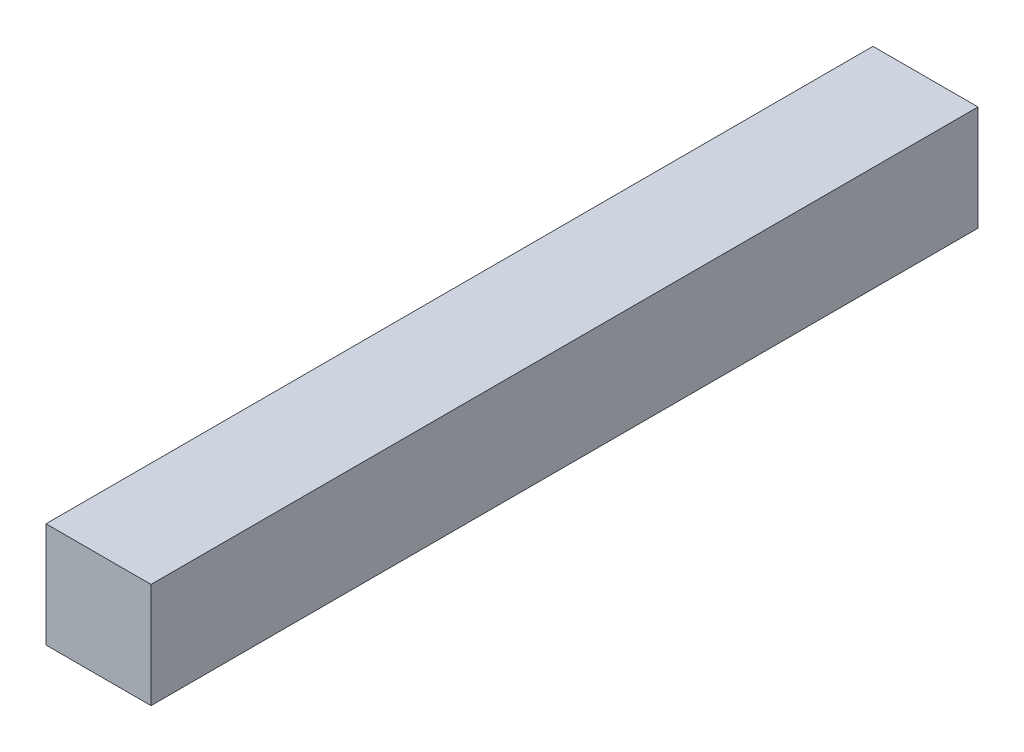
ISO-10303-21;
HEADER;
FILE_DESCRIPTION(('STEP AP214'),'2;1');
FILE_NAME('part.step','',(''),(''),'','','');
FILE_SCHEMA(('AUTOMOTIVE_DESIGN { 1 0 10303 214 1 1 1 1 }'));
ENDSEC;
DATA;
#1=APPLICATION_CONTEXT('core data for automotive mechanical design processes');
#2=APPLICATION_PROTOCOL_DEFINITION('international standard','automotive_design',2000,#1);
#3=PRODUCT_CONTEXT('',#1,'mechanical');
#4=PRODUCT('Part','Part','',(#3));
#5=PRODUCT_RELATED_PRODUCT_CATEGORY('part','',(#4));
#6=PRODUCT_DEFINITION_FORMATION('','',#4);
#7=PRODUCT_DEFINITION_CONTEXT('part definition',#1,'design');
#8=PRODUCT_DEFINITION('design','',#6,#7);
#9=PRODUCT_DEFINITION_SHAPE('','',#8);
#10=(LENGTH_UNIT() NAMED_UNIT(*) SI_UNIT(.MILLI.,.METRE.));
#11=(NAMED_UNIT(*) PLANE_ANGLE_UNIT() SI_UNIT($,.RADIAN.));
#12=(NAMED_UNIT(*) SI_UNIT($,.STERADIAN.) SOLID_ANGLE_UNIT());
#13=UNCERTAINTY_MEASURE_WITH_UNIT(LENGTH_MEASURE(1.E-05),#10,'distance_accuracy_value','');
#14=(GEOMETRIC_REPRESENTATION_CONTEXT(3) GLOBAL_UNCERTAINTY_ASSIGNED_CONTEXT((#13)) GLOBAL_UNIT_ASSIGNED_CONTEXT((#10,
#11,#12)) REPRESENTATION_CONTEXT('',''));
#15=CARTESIAN_POINT('',(0.,0.,0.));
#16=DIRECTION('',(0.,0.,1.));
#17=DIRECTION('',(1.,0.,0.));
#18=AXIS2_PLACEMENT_3D('',#15,#16,#17);
#19=CARTESIAN_POINT('',(1.5875,-1.5875,25.));
#20=DIRECTION('',(-1.,0.,0.));
#21=DIRECTION('',(0.,0.,1.));
#22=AXIS2_PLACEMENT_3D('',#19,#20,#21);
#23=PLANE('',#22);
#24=DIRECTION('',(0.,1.,0.));
#25=VECTOR('',#24,1.);
#26=CARTESIAN_POINT('',(1.5875,-1.5875,0.));
#27=LINE('',#26,#25);
#28=CARTESIAN_POINT('',(1.5875,-1.5875,0.));
#29=VERTEX_POINT('',#28);
#30=CARTESIAN_POINT('',(1.5875,1.5875,0.));
#31=VERTEX_POINT('',#30);
#32=EDGE_CURVE('E107',#29,#31,#27,.T.);
#33=ORIENTED_EDGE('',*,*,#32,.T.);
#34=DIRECTION('',(0.,0.,-1.));
#35=VECTOR('',#34,1.);
#36=CARTESIAN_POINT('',(1.5875,1.5875,25.));
#37=LINE('',#36,#35);
#38=CARTESIAN_POINT('',(1.5875,1.5875,25.));
#39=VERTEX_POINT('',#38);
#40=EDGE_CURVE('E11',#39,#31,#37,.T.);
#41=ORIENTED_EDGE('',*,*,#40,.F.);
#42=DIRECTION('',(0.,1.,0.));
#43=VECTOR('',#42,1.);
#44=CARTESIAN_POINT('',(1.5875,-1.5875,25.));
#45=LINE('',#44,#43);
#46=CARTESIAN_POINT('',(1.5875,-1.5875,25.));
#47=VERTEX_POINT('',#46);
#48=EDGE_CURVE('E91',#47,#39,#45,.T.);
#49=ORIENTED_EDGE('',*,*,#48,.F.);
#50=DIRECTION('',(0.,0.,-1.));
#51=VECTOR('',#50,1.);
#52=CARTESIAN_POINT('',(1.5875,-1.5875,25.));
#53=LINE('',#52,#51);
#54=EDGE_CURVE('E103',#47,#29,#53,.T.);
#55=ORIENTED_EDGE('',*,*,#54,.T.);
#56=EDGE_LOOP('',(#33,#41,#49,#55));
#57=FACE_BOUND('',#56,.T.);
#58=ADVANCED_FACE('F39',(#57),#23,.F.);
#59=CARTESIAN_POINT('',(-1.5875,1.5875,25.));
#60=DIRECTION('',(0.,-1.,0.));
#61=DIRECTION('',(0.,0.,-1.));
#62=AXIS2_PLACEMENT_3D('',#59,#60,#61);
#63=PLANE('',#62);
#64=DIRECTION('',(-1.,0.,0.));
#65=VECTOR('',#64,1.);
#66=CARTESIAN_POINT('',(-1.5875,1.5875,0.));
#67=LINE('',#66,#65);
#68=CARTESIAN_POINT('',(-1.5875,1.5875,0.));
#69=VERTEX_POINT('',#68);
#70=EDGE_CURVE('E96',#31,#69,#67,.T.);
#71=ORIENTED_EDGE('',*,*,#70,.T.);
#72=DIRECTION('',(0.,0.,-1.));
#73=VECTOR('',#72,1.);
#74=CARTESIAN_POINT('',(-1.5875,1.5875,25.));
#75=LINE('',#74,#73);
#76=CARTESIAN_POINT('',(-1.5875,1.5875,25.));
#77=VERTEX_POINT('',#76);
#78=EDGE_CURVE('E48',#77,#69,#75,.T.);
#79=ORIENTED_EDGE('',*,*,#78,.F.);
#80=DIRECTION('',(-1.,0.,0.));
#81=VECTOR('',#80,1.);
#82=CARTESIAN_POINT('',(-1.5875,1.5875,25.));
#83=LINE('',#82,#81);
#84=EDGE_CURVE('E86',#39,#77,#83,.T.);
#85=ORIENTED_EDGE('',*,*,#84,.F.);
#86=ORIENTED_EDGE('',*,*,#40,.T.);
#87=EDGE_LOOP('',(#71,#79,#85,#86));
#88=FACE_BOUND('',#87,.T.);
#89=ADVANCED_FACE('F95',(#88),#63,.F.);
#90=CARTESIAN_POINT('',(-1.5875,-1.5875,25.));
#91=DIRECTION('',(1.,0.,0.));
#92=DIRECTION('',(0.,0.,-1.));
#93=AXIS2_PLACEMENT_3D('',#90,#91,#92);
#94=PLANE('',#93);
#95=DIRECTION('',(0.,-1.,0.));
#96=VECTOR('',#95,1.);
#97=CARTESIAN_POINT('',(-1.5875,-1.5875,0.));
#98=LINE('',#97,#96);
#99=CARTESIAN_POINT('',(-1.5875,-1.5875,0.));
#100=VERTEX_POINT('',#99);
#101=EDGE_CURVE('E73',#69,#100,#98,.T.);
#102=ORIENTED_EDGE('',*,*,#101,.T.);
#103=DIRECTION('',(0.,0.,-1.));
#104=VECTOR('',#103,1.);
#105=CARTESIAN_POINT('',(-1.5875,-1.5875,25.));
#106=LINE('',#105,#104);
#107=CARTESIAN_POINT('',(-1.5875,-1.5875,25.));
#108=VERTEX_POINT('',#107);
#109=EDGE_CURVE('E98',#108,#100,#106,.T.);
#110=ORIENTED_EDGE('',*,*,#109,.F.);
#111=DIRECTION('',(0.,-1.,0.));
#112=VECTOR('',#111,1.);
#113=CARTESIAN_POINT('',(-1.5875,-1.5875,25.));
#114=LINE('',#113,#112);
#115=EDGE_CURVE('E89',#77,#108,#114,.T.);
#116=ORIENTED_EDGE('',*,*,#115,.F.);
#117=ORIENTED_EDGE('',*,*,#78,.T.);
#118=EDGE_LOOP('',(#102,#110,#116,#117));
#119=FACE_BOUND('',#118,.T.);
#120=ADVANCED_FACE('F99',(#119),#94,.F.);
#121=CARTESIAN_POINT('',(-1.5875,-1.5875,25.));
#122=DIRECTION('',(0.,1.,0.));
#123=DIRECTION('',(0.,0.,1.));
#124=AXIS2_PLACEMENT_3D('',#121,#122,#123);
#125=PLANE('',#124);
#126=DIRECTION('',(1.,0.,0.));
#127=VECTOR('',#126,1.);
#128=CARTESIAN_POINT('',(-1.5875,-1.5875,0.));
#129=LINE('',#128,#127);
#130=EDGE_CURVE('E79',#100,#29,#129,.T.);
#131=ORIENTED_EDGE('',*,*,#130,.T.);
#132=ORIENTED_EDGE('',*,*,#54,.F.);
#133=DIRECTION('',(1.,0.,0.));
#134=VECTOR('',#133,1.);
#135=CARTESIAN_POINT('',(-1.5875,-1.5875,25.));
#136=LINE('',#135,#134);
#137=EDGE_CURVE('E56',#108,#47,#136,.T.);
#138=ORIENTED_EDGE('',*,*,#137,.F.);
#139=ORIENTED_EDGE('',*,*,#109,.T.);
#140=EDGE_LOOP('',(#131,#132,#138,#139));
#141=FACE_BOUND('',#140,.T.);
#142=ADVANCED_FACE('F120',(#141),#125,.F.);
#143=CARTESIAN_POINT('',(0.,0.,25.));
#144=DIRECTION('',(0.,0.,-1.));
#145=DIRECTION('',(-1.,0.,0.));
#146=AXIS2_PLACEMENT_3D('',#143,#144,#145);
#147=PLANE('',#146);
#148=ORIENTED_EDGE('',*,*,#48,.T.);
#149=ORIENTED_EDGE('',*,*,#84,.T.);
#150=ORIENTED_EDGE('',*,*,#115,.T.);
#151=ORIENTED_EDGE('',*,*,#137,.T.);
#152=EDGE_LOOP('',(#148,#149,#150,#151));
#153=FACE_BOUND('',#152,.T.);
#154=ADVANCED_FACE('F87',(#153),#147,.F.);
#155=CARTESIAN_POINT('',(0.,0.,0.));
#156=DIRECTION('',(0.,0.,-1.));
#157=DIRECTION('',(-1.,0.,0.));
#158=AXIS2_PLACEMENT_3D('',#155,#156,#157);
#159=PLANE('',#158);
#160=ORIENTED_EDGE('',*,*,#32,.F.);
#161=ORIENTED_EDGE('',*,*,#130,.F.);
#162=ORIENTED_EDGE('',*,*,#101,.F.);
#163=ORIENTED_EDGE('',*,*,#70,.F.);
#164=EDGE_LOOP('',(#160,#161,#162,#163));
#165=FACE_BOUND('',#164,.T.);
#166=ADVANCED_FACE('F123',(#165),#159,.T.);
#167=CLOSED_SHELL('',(#58,#89,#120,#142,#154,#166));
#168=MANIFOLD_SOLID_BREP('B2',#167);
#169=ADVANCED_BREP_SHAPE_REPRESENTATION('',(#18,#168),#14);
#170=SHAPE_DEFINITION_REPRESENTATION(#9,#169);
ENDSEC;
END-ISO-10303-21;
